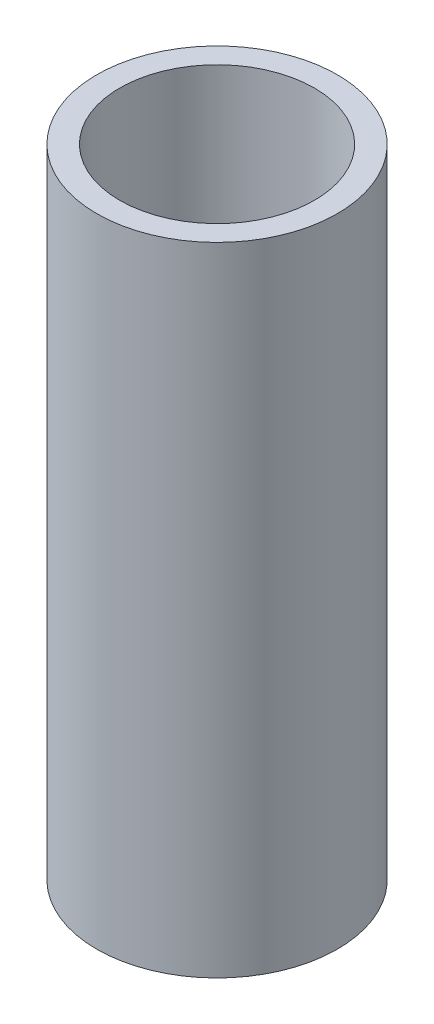
ISO-10303-21;
HEADER;
FILE_DESCRIPTION(('STEP AP214'),'2;1');
FILE_NAME('part.step','',(''),(''),'','','');
FILE_SCHEMA(('AUTOMOTIVE_DESIGN { 1 0 10303 214 1 1 1 1 }'));
ENDSEC;
DATA;
#1=APPLICATION_CONTEXT('core data for automotive mechanical design processes');
#2=APPLICATION_PROTOCOL_DEFINITION('international standard','automotive_design',2000,#1);
#3=PRODUCT_CONTEXT('',#1,'mechanical');
#4=PRODUCT('Part','Part','',(#3));
#5=PRODUCT_RELATED_PRODUCT_CATEGORY('part','',(#4));
#6=PRODUCT_DEFINITION_FORMATION('','',#4);
#7=PRODUCT_DEFINITION_CONTEXT('part definition',#1,'design');
#8=PRODUCT_DEFINITION('design','',#6,#7);
#9=PRODUCT_DEFINITION_SHAPE('','',#8);
#10=(LENGTH_UNIT() NAMED_UNIT(*) SI_UNIT(.MILLI.,.METRE.));
#11=(NAMED_UNIT(*) PLANE_ANGLE_UNIT() SI_UNIT($,.RADIAN.));
#12=(NAMED_UNIT(*) SI_UNIT($,.STERADIAN.) SOLID_ANGLE_UNIT());
#13=UNCERTAINTY_MEASURE_WITH_UNIT(LENGTH_MEASURE(1.E-05),#10,'distance_accuracy_value','');
#14=(GEOMETRIC_REPRESENTATION_CONTEXT(3) GLOBAL_UNCERTAINTY_ASSIGNED_CONTEXT((#13)) GLOBAL_UNIT_ASSIGNED_CONTEXT((#10,
#11,#12)) REPRESENTATION_CONTEXT('',''));
#15=CARTESIAN_POINT('',(0.,0.,0.));
#16=DIRECTION('',(0.,0.,1.));
#17=DIRECTION('',(1.,0.,0.));
#18=AXIS2_PLACEMENT_3D('',#15,#16,#17);
#19=CARTESIAN_POINT('',(0.,180.,0.));
#20=DIRECTION('',(0.,-1.,0.));
#21=DIRECTION('',(0.,0.,-1.));
#22=AXIS2_PLACEMENT_3D('',#19,#20,#21);
#23=CYLINDRICAL_SURFACE('',#22,27.5);
#24=CARTESIAN_POINT('',(0.,180.,0.));
#25=DIRECTION('',(0.,-1.,0.));
#26=DIRECTION('',(0.,0.,-1.));
#27=AXIS2_PLACEMENT_3D('',#24,#25,#26);
#28=CIRCLE('',#27,27.5);
#29=CARTESIAN_POINT('',(0.,180.,-27.5));
#30=VERTEX_POINT('',#29);
#31=EDGE_CURVE('E42',#30,#30,#28,.T.);
#32=ORIENTED_EDGE('',*,*,#31,.F.);
#33=EDGE_LOOP('',(#32));
#34=FACE_BOUND('',#33,.T.);
#35=CARTESIAN_POINT('',(0.,39.,0.));
#36=DIRECTION('',(0.,-1.,0.));
#37=DIRECTION('',(0.,0.,-1.));
#38=AXIS2_PLACEMENT_3D('',#35,#36,#37);
#39=CIRCLE('',#38,27.5);
#40=CARTESIAN_POINT('',(0.,39.,-27.5));
#41=VERTEX_POINT('',#40);
#42=EDGE_CURVE('E56',#41,#41,#39,.T.);
#43=ORIENTED_EDGE('',*,*,#42,.T.);
#44=EDGE_LOOP('',(#43));
#45=FACE_BOUND('',#44,.T.);
#46=ADVANCED_FACE('F31',(#34,#45),#23,.F.);
#47=CARTESIAN_POINT('',(0.,180.,0.));
#48=DIRECTION('',(0.,-1.,0.));
#49=DIRECTION('',(0.,0.,-1.));
#50=AXIS2_PLACEMENT_3D('',#47,#48,#49);
#51=CYLINDRICAL_SURFACE('',#50,34.);
#52=CARTESIAN_POINT('',(0.,180.,0.));
#53=DIRECTION('',(0.,1.,0.));
#54=DIRECTION('',(0.,0.,1.));
#55=AXIS2_PLACEMENT_3D('',#52,#53,#54);
#56=CIRCLE('',#55,34.);
#57=CARTESIAN_POINT('',(0.,180.,34.));
#58=VERTEX_POINT('',#57);
#59=EDGE_CURVE('E10',#58,#58,#56,.T.);
#60=ORIENTED_EDGE('',*,*,#59,.F.);
#61=EDGE_LOOP('',(#60));
#62=FACE_BOUND('',#61,.T.);
#63=CARTESIAN_POINT('',(0.,0.,0.));
#64=DIRECTION('',(0.,1.,0.));
#65=DIRECTION('',(0.,0.,1.));
#66=AXIS2_PLACEMENT_3D('',#63,#64,#65);
#67=CIRCLE('',#66,34.);
#68=CARTESIAN_POINT('',(0.,0.,34.));
#69=VERTEX_POINT('',#68);
#70=EDGE_CURVE('E35',#69,#69,#67,.T.);
#71=ORIENTED_EDGE('',*,*,#70,.T.);
#72=EDGE_LOOP('',(#71));
#73=FACE_BOUND('',#72,.T.);
#74=ADVANCED_FACE('F33',(#62,#73),#51,.T.);
#75=CARTESIAN_POINT('',(0.,180.,0.));
#76=DIRECTION('',(0.,1.,0.));
#77=DIRECTION('',(0.,0.,1.));
#78=AXIS2_PLACEMENT_3D('',#75,#76,#77);
#79=PLANE('',#78);
#80=ORIENTED_EDGE('',*,*,#31,.T.);
#81=EDGE_LOOP('',(#80));
#82=FACE_BOUND('',#81,.T.);
#83=ORIENTED_EDGE('',*,*,#59,.T.);
#84=EDGE_LOOP('',(#83));
#85=FACE_BOUND('',#84,.T.);
#86=ADVANCED_FACE('F73',(#82,#85),#79,.T.);
#87=CARTESIAN_POINT('',(0.,0.,0.));
#88=DIRECTION('',(0.,1.,0.));
#89=DIRECTION('',(0.,0.,1.));
#90=AXIS2_PLACEMENT_3D('',#87,#88,#89);
#91=PLANE('',#90);
#92=CARTESIAN_POINT('',(0.,0.,0.));
#93=DIRECTION('',(0.,-1.,0.));
#94=DIRECTION('',(0.,0.,-1.));
#95=AXIS2_PLACEMENT_3D('',#92,#93,#94);
#96=CIRCLE('',#95,27.5);
#97=CARTESIAN_POINT('',(0.,0.,-27.5));
#98=VERTEX_POINT('',#97);
#99=EDGE_CURVE('E44',#98,#98,#96,.T.);
#100=ORIENTED_EDGE('',*,*,#99,.F.);
#101=EDGE_LOOP('',(#100));
#102=FACE_BOUND('',#101,.T.);
#103=ORIENTED_EDGE('',*,*,#70,.F.);
#104=EDGE_LOOP('',(#103));
#105=FACE_BOUND('',#104,.T.);
#106=ADVANCED_FACE('F67',(#102,#105),#91,.F.);
#107=CARTESIAN_POINT('',(0.,37.,0.));
#108=DIRECTION('',(0.,-1.,0.));
#109=DIRECTION('',(0.,0.,-1.));
#110=AXIS2_PLACEMENT_3D('',#107,#108,#109);
#111=CIRCLE('',#110,27.5);
#112=CARTESIAN_POINT('',(0.,37.,-27.5));
#113=VERTEX_POINT('',#112);
#114=EDGE_CURVE('E53',#113,#113,#111,.T.);
#115=ORIENTED_EDGE('',*,*,#114,.F.);
#116=EDGE_LOOP('',(#115));
#117=FACE_BOUND('',#116,.T.);
#118=ORIENTED_EDGE('',*,*,#99,.T.);
#119=EDGE_LOOP('',(#118));
#120=FACE_BOUND('',#119,.T.);
#121=ADVANCED_FACE('F64',(#117,#120),#23,.F.);
#122=CARTESIAN_POINT('',(0.,37.,0.));
#123=DIRECTION('',(0.,-1.,0.));
#124=DIRECTION('',(0.,0.,-1.));
#125=AXIS2_PLACEMENT_3D('',#122,#123,#124);
#126=PLANE('',#125);
#127=CARTESIAN_POINT('',(0.,37.,0.));
#128=DIRECTION('',(0.,-1.,0.));
#129=DIRECTION('',(0.,0.,-1.));
#130=AXIS2_PLACEMENT_3D('',#127,#128,#129);
#131=CIRCLE('',#130,28.5);
#132=CARTESIAN_POINT('',(0.,37.,-28.5));
#133=VERTEX_POINT('',#132);
#134=EDGE_CURVE('E47',#133,#133,#131,.T.);
#135=ORIENTED_EDGE('',*,*,#134,.F.);
#136=EDGE_LOOP('',(#135));
#137=FACE_BOUND('',#136,.T.);
#138=ORIENTED_EDGE('',*,*,#114,.T.);
#139=EDGE_LOOP('',(#138));
#140=FACE_BOUND('',#139,.T.);
#141=ADVANCED_FACE('F62',(#137,#140),#126,.F.);
#142=CARTESIAN_POINT('',(0.,39.,0.));
#143=DIRECTION('',(0.,-1.,0.));
#144=DIRECTION('',(0.,0.,-1.));
#145=AXIS2_PLACEMENT_3D('',#142,#143,#144);
#146=PLANE('',#145);
#147=CARTESIAN_POINT('',(0.,39.,0.));
#148=DIRECTION('',(0.,-1.,0.));
#149=DIRECTION('',(0.,0.,-1.));
#150=AXIS2_PLACEMENT_3D('',#147,#148,#149);
#151=CIRCLE('',#150,28.5);
#152=CARTESIAN_POINT('',(0.,39.,-28.5));
#153=VERTEX_POINT('',#152);
#154=EDGE_CURVE('E50',#153,#153,#151,.T.);
#155=ORIENTED_EDGE('',*,*,#154,.T.);
#156=EDGE_LOOP('',(#155));
#157=FACE_BOUND('',#156,.T.);
#158=ORIENTED_EDGE('',*,*,#42,.F.);
#159=EDGE_LOOP('',(#158));
#160=FACE_BOUND('',#159,.T.);
#161=ADVANCED_FACE('F93',(#157,#160),#146,.T.);
#162=CARTESIAN_POINT('',(0.,37.,0.));
#163=DIRECTION('',(0.,1.,0.));
#164=DIRECTION('',(0.,0.,1.));
#165=AXIS2_PLACEMENT_3D('',#162,#163,#164);
#166=CYLINDRICAL_SURFACE('',#165,28.5);
#167=ORIENTED_EDGE('',*,*,#134,.T.);
#168=EDGE_LOOP('',(#167));
#169=FACE_BOUND('',#168,.T.);
#170=ORIENTED_EDGE('',*,*,#154,.F.);
#171=EDGE_LOOP('',(#170));
#172=FACE_BOUND('',#171,.T.);
#173=ADVANCED_FACE('F90',(#169,#172),#166,.F.);
#174=CLOSED_SHELL('',(#46,#74,#86,#106,#121,#141,#161,#173));
#175=MANIFOLD_SOLID_BREP('B2',#174);
#176=ADVANCED_BREP_SHAPE_REPRESENTATION('',(#18,#175),#14);
#177=SHAPE_DEFINITION_REPRESENTATION(#9,#176);
ENDSEC;
END-ISO-10303-21;
